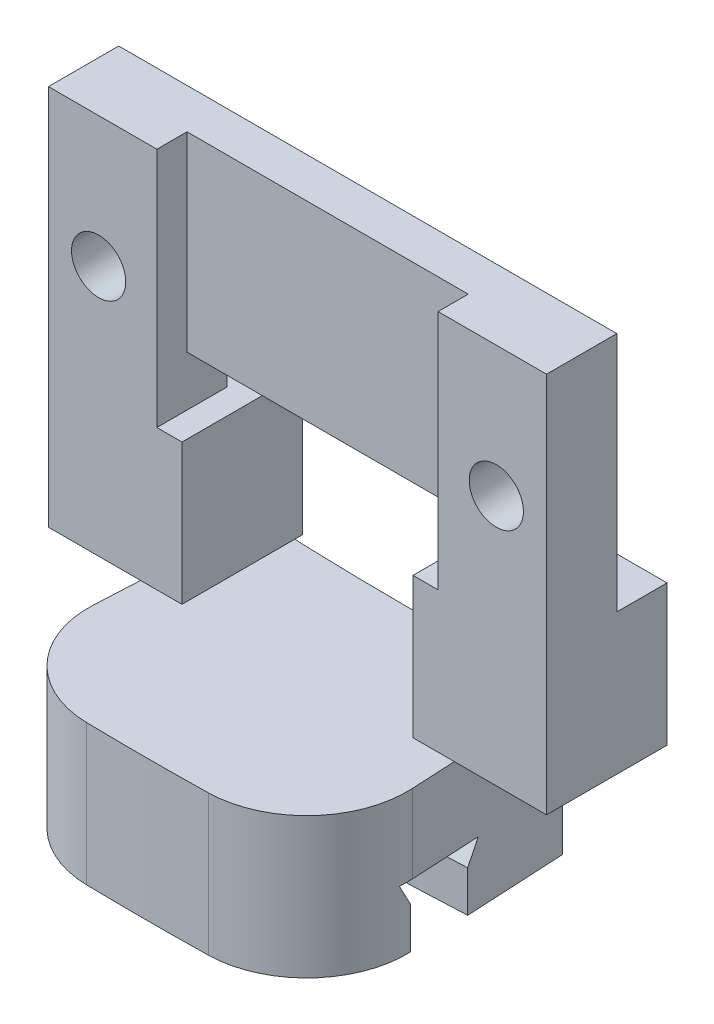
ISO-10303-21;
HEADER;
FILE_DESCRIPTION(('STEP AP214'),'2;1');
FILE_NAME('part.step','',(''),(''),'','','');
FILE_SCHEMA(('AUTOMOTIVE_DESIGN { 1 0 10303 214 1 1 1 1 }'));
ENDSEC;
DATA;
#1=APPLICATION_CONTEXT('core data for automotive mechanical design processes');
#2=APPLICATION_PROTOCOL_DEFINITION('international standard','automotive_design',2000,#1);
#3=PRODUCT_CONTEXT('',#1,'mechanical');
#4=PRODUCT('Part','Part','',(#3));
#5=PRODUCT_RELATED_PRODUCT_CATEGORY('part','',(#4));
#6=PRODUCT_DEFINITION_FORMATION('','',#4);
#7=PRODUCT_DEFINITION_CONTEXT('part definition',#1,'design');
#8=PRODUCT_DEFINITION('design','',#6,#7);
#9=PRODUCT_DEFINITION_SHAPE('','',#8);
#10=(LENGTH_UNIT() NAMED_UNIT(*) SI_UNIT(.MILLI.,.METRE.));
#11=(NAMED_UNIT(*) PLANE_ANGLE_UNIT() SI_UNIT($,.RADIAN.));
#12=(NAMED_UNIT(*) SI_UNIT($,.STERADIAN.) SOLID_ANGLE_UNIT());
#13=UNCERTAINTY_MEASURE_WITH_UNIT(LENGTH_MEASURE(1.E-05),#10,'distance_accuracy_value','');
#14=(GEOMETRIC_REPRESENTATION_CONTEXT(3) GLOBAL_UNCERTAINTY_ASSIGNED_CONTEXT((#13)) GLOBAL_UNIT_ASSIGNED_CONTEXT((#10,
#11,#12)) REPRESENTATION_CONTEXT('',''));
#15=CARTESIAN_POINT('',(0.,0.,0.));
#16=DIRECTION('',(0.,0.,1.));
#17=DIRECTION('',(1.,0.,0.));
#18=AXIS2_PLACEMENT_3D('',#15,#16,#17);
#19=CARTESIAN_POINT('',(0.,11.,0.));
#20=DIRECTION('',(0.,1.,0.));
#21=DIRECTION('',(0.,0.,1.));
#22=AXIS2_PLACEMENT_3D('',#19,#20,#21);
#23=CYLINDRICAL_SURFACE('',#22,151.5);
#24=CARTESIAN_POINT('',(0.,-4.95,0.));
#25=DIRECTION('',(0.,1.,0.));
#26=DIRECTION('',(0.,0.,1.));
#27=AXIS2_PLACEMENT_3D('',#24,#25,#26);
#28=CIRCLE('',#27,151.5);
#29=CARTESIAN_POINT('',(-7.92821712573561,-4.95,151.292410163918));
#30=VERTEX_POINT('',#29);
#31=CARTESIAN_POINT('',(7.92821712573562,-4.95,151.292410163918));
#32=VERTEX_POINT('',#31);
#33=EDGE_CURVE('E185',#30,#32,#28,.T.);
#34=ORIENTED_EDGE('',*,*,#33,.T.);
#35=DIRECTION('',(0.,1.,0.));
#36=VECTOR('',#35,1.);
#37=CARTESIAN_POINT('',(7.92821712573562,-4.95,151.292410163918));
#38=LINE('',#37,#36);
#39=CARTESIAN_POINT('',(7.92821712573505,-7.,151.292410163918));
#40=VERTEX_POINT('',#39);
#41=EDGE_CURVE('E273',#32,#40,#38,.F.);
#42=ORIENTED_EDGE('',*,*,#41,.T.);
#43=CARTESIAN_POINT('',(0.,-7.,0.));
#44=DIRECTION('',(0.,1.,0.));
#45=DIRECTION('',(0.,0.,1.));
#46=AXIS2_PLACEMENT_3D('',#43,#44,#45);
#47=CIRCLE('',#46,151.5);
#48=CARTESIAN_POINT('',(-7.92821712573561,-7.,151.292410163918));
#49=VERTEX_POINT('',#48);
#50=EDGE_CURVE('E201',#49,#40,#47,.T.);
#51=ORIENTED_EDGE('',*,*,#50,.F.);
#52=DIRECTION('',(0.,1.,0.));
#53=VECTOR('',#52,1.);
#54=CARTESIAN_POINT('',(-7.92821712573561,-7.,151.292410163918));
#55=LINE('',#54,#53);
#56=EDGE_CURVE('E275',#49,#30,#55,.T.);
#57=ORIENTED_EDGE('',*,*,#56,.T.);
#58=EDGE_LOOP('',(#34,#42,#51,#57));
#59=FACE_BOUND('',#58,.T.);
#60=ADVANCED_FACE('F43',(#59),#23,.F.);
#61=CARTESIAN_POINT('',(-7.92889737080601,-7.,151.292374515318));
#62=DIRECTION('',(0.,-1.,0.));
#63=DIRECTION('',(0.,0.,-1.));
#64=AXIS2_PLACEMENT_3D('',#61,#62,#63);
#65=PLANE('',#64);
#66=ORIENTED_EDGE('',*,*,#50,.T.);
#67=CARTESIAN_POINT('',(2.93143037233645,-7.,151.471636671597));
#68=DIRECTION('',(0.,-1.,0.));
#69=DIRECTION('',(0.,0.,-1.));
#70=AXIS2_PLACEMENT_3D('',#67,#68,#69);
#71=CIRCLE('',#70,5.);
#72=CARTESIAN_POINT('',(3.02817724931125,-7.,156.470700588151));
#73=VERTEX_POINT('',#72);
#74=EDGE_CURVE('E279',#40,#73,#71,.T.);
#75=ORIENTED_EDGE('',*,*,#74,.T.);
#76=CARTESIAN_POINT('',(0.,-7.,0.));
#77=DIRECTION('',(0.,1.,0.));
#78=DIRECTION('',(0.,0.,1.));
#79=AXIS2_PLACEMENT_3D('',#76,#77,#78);
#80=CIRCLE('',#79,156.5);
#81=CARTESIAN_POINT('',(-3.02817724931125,-7.,156.470700588151));
#82=VERTEX_POINT('',#81);
#83=EDGE_CURVE('E199',#82,#73,#80,.T.);
#84=ORIENTED_EDGE('',*,*,#83,.F.);
#85=CARTESIAN_POINT('',(-2.93143037233645,-7.,151.471636671597));
#86=DIRECTION('',(0.,-1.,0.));
#87=DIRECTION('',(0.,0.,-1.));
#88=AXIS2_PLACEMENT_3D('',#85,#86,#87);
#89=CIRCLE('',#88,5.);
#90=EDGE_CURVE('E280',#82,#49,#89,.T.);
#91=ORIENTED_EDGE('',*,*,#90,.T.);
#92=EDGE_LOOP('',(#66,#75,#84,#91));
#93=FACE_BOUND('',#92,.T.);
#94=ADVANCED_FACE('F252',(#93),#65,.T.);
#95=CARTESIAN_POINT('',(0.,11.,0.));
#96=DIRECTION('',(0.,1.,0.));
#97=DIRECTION('',(0.,0.,1.));
#98=AXIS2_PLACEMENT_3D('',#95,#96,#97);
#99=CYLINDRICAL_SURFACE('',#98,156.5);
#100=ORIENTED_EDGE('',*,*,#83,.T.);
#101=DIRECTION('',(0.,1.,0.));
#102=VECTOR('',#101,1.);
#103=CARTESIAN_POINT('',(3.02817724931125,11.,156.470700588151));
#104=LINE('',#103,#102);
#105=CARTESIAN_POINT('',(3.02817724931125,0.,156.470700588151));
#106=VERTEX_POINT('',#105);
#107=EDGE_CURVE('E65',#73,#106,#104,.T.);
#108=ORIENTED_EDGE('',*,*,#107,.T.);
#109=CARTESIAN_POINT('',(0.,0.,0.));
#110=DIRECTION('',(0.,1.,0.));
#111=DIRECTION('',(0.,0.,1.));
#112=AXIS2_PLACEMENT_3D('',#109,#110,#111);
#113=CIRCLE('',#112,156.5);
#114=CARTESIAN_POINT('',(-3.02817724931125,0.,156.470700588151));
#115=VERTEX_POINT('',#114);
#116=EDGE_CURVE('E197',#115,#106,#113,.T.);
#117=ORIENTED_EDGE('',*,*,#116,.F.);
#118=DIRECTION('',(0.,1.,0.));
#119=VECTOR('',#118,1.);
#120=CARTESIAN_POINT('',(-3.02817724931125,11.,156.470700588151));
#121=LINE('',#120,#119);
#122=EDGE_CURVE('E285',#115,#82,#121,.F.);
#123=ORIENTED_EDGE('',*,*,#122,.T.);
#124=EDGE_LOOP('',(#100,#108,#117,#123));
#125=FACE_BOUND('',#124,.T.);
#126=ADVANCED_FACE('F248',(#125),#99,.T.);
#127=CARTESIAN_POINT('',(-7.51020972086246,0.,143.303338237281));
#128=DIRECTION('',(0.,1.,0.));
#129=DIRECTION('',(0.,0.,1.));
#130=AXIS2_PLACEMENT_3D('',#127,#128,#129);
#131=PLANE('',#130);
#132=ORIENTED_EDGE('',*,*,#116,.T.);
#133=CARTESIAN_POINT('',(2.93143037233645,0.,151.471636671597));
#134=DIRECTION('',(0.,1.,0.));
#135=DIRECTION('',(0.,0.,1.));
#136=AXIS2_PLACEMENT_3D('',#133,#134,#135);
#137=CIRCLE('',#136,5.);
#138=CARTESIAN_POINT('',(7.92457804610933,0.,151.209956890382));
#139=VERTEX_POINT('',#138);
#140=EDGE_CURVE('E52',#106,#139,#137,.T.);
#141=ORIENTED_EDGE('',*,*,#140,.T.);
#142=DIRECTION('',(0.052335956242944,0.,0.998629534754574));
#143=VECTOR('',#142,1.);
#144=CARTESIAN_POINT('',(7.51020972086246,0.,143.303338237281));
#145=LINE('',#144,#143);
#146=CARTESIAN_POINT('',(7.51020972086246,0.,143.303338237281));
#147=VERTEX_POINT('',#146);
#148=EDGE_CURVE('E169',#147,#139,#145,.T.);
#149=ORIENTED_EDGE('',*,*,#148,.F.);
#150=CARTESIAN_POINT('',(0.,0.,0.));
#151=DIRECTION('',(0.,1.,0.));
#152=DIRECTION('',(0.,0.,1.));
#153=AXIS2_PLACEMENT_3D('',#150,#151,#152);
#154=CIRCLE('',#153,143.5);
#155=CARTESIAN_POINT('',(-7.51020972086246,0.,143.303338237281));
#156=VERTEX_POINT('',#155);
#157=EDGE_CURVE('E195',#156,#147,#154,.T.);
#158=ORIENTED_EDGE('',*,*,#157,.F.);
#159=DIRECTION('',(-0.0523359562429439,0.,0.998629534754574));
#160=VECTOR('',#159,1.);
#161=CARTESIAN_POINT('',(-7.51020972086246,0.,143.303338237281));
#162=LINE('',#161,#160);
#163=CARTESIAN_POINT('',(-7.92457804610932,0.,151.209956890382));
#164=VERTEX_POINT('',#163);
#165=EDGE_CURVE('E183',#156,#164,#162,.T.);
#166=ORIENTED_EDGE('',*,*,#165,.T.);
#167=CARTESIAN_POINT('',(-2.93143037233645,0.,151.471636671597));
#168=DIRECTION('',(0.,1.,0.));
#169=DIRECTION('',(0.,0.,1.));
#170=AXIS2_PLACEMENT_3D('',#167,#168,#169);
#171=CIRCLE('',#170,5.);
#172=EDGE_CURVE('E289',#164,#115,#171,.T.);
#173=ORIENTED_EDGE('',*,*,#172,.T.);
#174=EDGE_LOOP('',(#132,#141,#149,#158,#166,#173));
#175=FACE_BOUND('',#174,.T.);
#176=ADVANCED_FACE('F244',(#175),#131,.T.);
#177=CARTESIAN_POINT('',(0.,11.,0.));
#178=DIRECTION('',(0.,1.,0.));
#179=DIRECTION('',(0.,0.,1.));
#180=AXIS2_PLACEMENT_3D('',#177,#178,#179);
#181=CYLINDRICAL_SURFACE('',#180,143.5);
#182=CARTESIAN_POINT('',(0.,-7.,0.));
#183=DIRECTION('',(0.,1.,0.));
#184=DIRECTION('',(0.,0.,1.));
#185=AXIS2_PLACEMENT_3D('',#182,#183,#184);
#186=CIRCLE('',#185,143.5);
#187=CARTESIAN_POINT('',(-7.51020972086246,-7.,143.303338237281));
#188=VERTEX_POINT('',#187);
#189=CARTESIAN_POINT('',(7.51020972086246,-7.,143.303338237281));
#190=VERTEX_POINT('',#189);
#191=EDGE_CURVE('E193',#188,#190,#186,.T.);
#192=ORIENTED_EDGE('',*,*,#191,.F.);
#193=DIRECTION('',(0.,1.,0.));
#194=VECTOR('',#193,1.);
#195=CARTESIAN_POINT('',(-7.51020972086246,-7.,143.303338237281));
#196=LINE('',#195,#194);
#197=EDGE_CURVE('E180',#188,#156,#196,.T.);
#198=ORIENTED_EDGE('',*,*,#197,.T.);
#199=ORIENTED_EDGE('',*,*,#157,.T.);
#200=DIRECTION('',(0.,1.,0.));
#201=VECTOR('',#200,1.);
#202=CARTESIAN_POINT('',(7.51020972086246,-7.,143.303338237281));
#203=LINE('',#202,#201);
#204=EDGE_CURVE('E166',#190,#147,#203,.T.);
#205=ORIENTED_EDGE('',*,*,#204,.F.);
#206=EDGE_LOOP('',(#192,#198,#199,#205));
#207=FACE_BOUND('',#206,.T.);
#208=ADVANCED_FACE('F240',(#207),#181,.F.);
#209=CARTESIAN_POINT('',(-7.77188950207718,-7.,148.296485911054));
#210=DIRECTION('',(0.,-1.,0.));
#211=DIRECTION('',(0.,0.,-1.));
#212=AXIS2_PLACEMENT_3D('',#209,#210,#211);
#213=PLANE('',#212);
#214=CARTESIAN_POINT('',(0.,-7.,0.));
#215=DIRECTION('',(0.,1.,0.));
#216=DIRECTION('',(0.,0.,1.));
#217=AXIS2_PLACEMENT_3D('',#214,#215,#216);
#218=CIRCLE('',#217,148.5);
#219=CARTESIAN_POINT('',(-7.77188950207718,-7.,148.296485911054));
#220=VERTEX_POINT('',#219);
#221=CARTESIAN_POINT('',(7.77188950207718,-7.,148.296485911054));
#222=VERTEX_POINT('',#221);
#223=EDGE_CURVE('E191',#220,#222,#218,.T.);
#224=ORIENTED_EDGE('',*,*,#223,.F.);
#225=DIRECTION('',(0.052335956242944,0.,-0.998629534754574));
#226=VECTOR('',#225,1.);
#227=CARTESIAN_POINT('',(-7.77188950207718,-7.,148.296485911054));
#228=LINE('',#227,#226);
#229=EDGE_CURVE('E177',#220,#188,#228,.T.);
#230=ORIENTED_EDGE('',*,*,#229,.T.);
#231=ORIENTED_EDGE('',*,*,#191,.T.);
#232=DIRECTION('',(-0.052335956242944,0.,-0.998629534754574));
#233=VECTOR('',#232,1.);
#234=CARTESIAN_POINT('',(7.77188950207718,-7.,148.296485911054));
#235=LINE('',#234,#233);
#236=EDGE_CURVE('E161',#222,#190,#235,.T.);
#237=ORIENTED_EDGE('',*,*,#236,.F.);
#238=EDGE_LOOP('',(#224,#230,#231,#237));
#239=FACE_BOUND('',#238,.T.);
#240=ADVANCED_FACE('F236',(#239),#213,.T.);
#241=CARTESIAN_POINT('',(0.,11.,0.));
#242=DIRECTION('',(0.,1.,0.));
#243=DIRECTION('',(0.,0.,1.));
#244=AXIS2_PLACEMENT_3D('',#241,#242,#243);
#245=CYLINDRICAL_SURFACE('',#244,148.5);
#246=CARTESIAN_POINT('',(0.,-4.95,0.));
#247=DIRECTION('',(0.,1.,0.));
#248=DIRECTION('',(0.,0.,1.));
#249=AXIS2_PLACEMENT_3D('',#246,#247,#248);
#250=CIRCLE('',#249,148.5);
#251=CARTESIAN_POINT('',(-7.77188950207718,-4.95,148.296485911054));
#252=VERTEX_POINT('',#251);
#253=CARTESIAN_POINT('',(7.77188950207718,-4.95,148.296485911054));
#254=VERTEX_POINT('',#253);
#255=EDGE_CURVE('E155',#252,#254,#250,.T.);
#256=ORIENTED_EDGE('',*,*,#255,.F.);
#257=DIRECTION('',(0.,-1.,0.));
#258=VECTOR('',#257,1.);
#259=CARTESIAN_POINT('',(-7.77188950207718,-4.95,148.296485911054));
#260=LINE('',#259,#258);
#261=EDGE_CURVE('E174',#252,#220,#260,.T.);
#262=ORIENTED_EDGE('',*,*,#261,.T.);
#263=ORIENTED_EDGE('',*,*,#223,.T.);
#264=DIRECTION('',(0.,-1.,0.));
#265=VECTOR('',#264,1.);
#266=CARTESIAN_POINT('',(7.77188950207718,-4.95,148.296485911054));
#267=LINE('',#266,#265);
#268=EDGE_CURVE('E159',#254,#222,#267,.T.);
#269=ORIENTED_EDGE('',*,*,#268,.F.);
#270=EDGE_LOOP('',(#256,#262,#263,#269));
#271=FACE_BOUND('',#270,.T.);
#272=ADVANCED_FACE('F233',(#271),#245,.T.);
#273=CARTESIAN_POINT('',(0.,-3.9,0.));
#274=DIRECTION('',(0.,-1.,0.));
#275=DIRECTION('',(0.,0.,-1.));
#276=AXIS2_PLACEMENT_3D('',#273,#274,#275);
#277=CONICAL_SURFACE('',#276,147.95,0.482513295022474);
#278=CARTESIAN_POINT('',(0.,-3.9,0.));
#279=DIRECTION('',(0.,1.,0.));
#280=DIRECTION('',(0.,0.,1.));
#281=AXIS2_PLACEMENT_3D('',#278,#279,#280);
#282=CIRCLE('',#281,147.95);
#283=CARTESIAN_POINT('',(-7.74310472614356,-3.9,147.747239666939));
#284=VERTEX_POINT('',#283);
#285=CARTESIAN_POINT('',(7.74310472614356,-3.9,147.747239666939));
#286=VERTEX_POINT('',#285);
#287=EDGE_CURVE('E149',#284,#286,#282,.T.);
#288=ORIENTED_EDGE('',*,*,#287,.F.);
#289=DIRECTION('',(-0.024284249769498,-0.885831535280157,0.463371089210723));
#290=VECTOR('',#289,1.);
#291=CARTESIAN_POINT('',(-7.74310472614356,-3.9,147.747239666939));
#292=LINE('',#291,#290);
#293=EDGE_CURVE('E172',#284,#252,#292,.T.);
#294=ORIENTED_EDGE('',*,*,#293,.T.);
#295=ORIENTED_EDGE('',*,*,#255,.T.);
#296=DIRECTION('',(0.024284249769498,-0.885831535280157,0.463371089210723));
#297=VECTOR('',#296,1.);
#298=CARTESIAN_POINT('',(7.74310472614356,-3.9,147.747239666939));
#299=LINE('',#298,#297);
#300=EDGE_CURVE('E142',#286,#254,#299,.T.);
#301=ORIENTED_EDGE('',*,*,#300,.F.);
#302=EDGE_LOOP('',(#288,#294,#295,#301));
#303=FACE_BOUND('',#302,.T.);
#304=ADVANCED_FACE('F158',(#303),#277,.T.);
#305=CARTESIAN_POINT('',(-7.74310472614356,-3.9,147.747239666939));
#306=DIRECTION('',(0.,-1.,0.));
#307=DIRECTION('',(0.,0.,-1.));
#308=AXIS2_PLACEMENT_3D('',#305,#306,#307);
#309=PLANE('',#308);
#310=DIRECTION('',(-0.052335956242944,0.,-0.998629534754574));
#311=VECTOR('',#310,1.);
#312=CARTESIAN_POINT('',(7.74310472614356,-3.9,147.747239666939));
#313=LINE('',#312,#311);
#314=CARTESIAN_POINT('',(7.92457804610933,-3.9,151.209956890382));
#315=VERTEX_POINT('',#314);
#316=EDGE_CURVE('E136',#315,#286,#313,.T.);
#317=ORIENTED_EDGE('',*,*,#316,.F.);
#318=CARTESIAN_POINT('',(2.93143037233645,-3.9,151.471636671597));
#319=DIRECTION('',(0.,-1.,0.));
#320=DIRECTION('',(0.,0.,-1.));
#321=AXIS2_PLACEMENT_3D('',#318,#319,#320);
#322=CIRCLE('',#321,5.);
#323=CARTESIAN_POINT('',(7.91756671513949,-3.9,151.843717806537));
#324=VERTEX_POINT('',#323);
#325=EDGE_CURVE('E207',#315,#324,#322,.T.);
#326=ORIENTED_EDGE('',*,*,#325,.T.);
#327=CARTESIAN_POINT('',(0.,-3.9,0.));
#328=DIRECTION('',(0.,1.,0.));
#329=DIRECTION('',(0.,0.,1.));
#330=AXIS2_PLACEMENT_3D('',#327,#328,#329);
#331=CIRCLE('',#330,152.05);
#332=CARTESIAN_POINT('',(-7.91756671513931,-3.9,151.843717806537));
#333=VERTEX_POINT('',#332);
#334=EDGE_CURVE('E156',#333,#324,#331,.T.);
#335=ORIENTED_EDGE('',*,*,#334,.F.);
#336=CARTESIAN_POINT('',(-2.93143037233645,-3.9,151.471636671597));
#337=DIRECTION('',(0.,-1.,0.));
#338=DIRECTION('',(0.,0.,-1.));
#339=AXIS2_PLACEMENT_3D('',#336,#337,#338);
#340=CIRCLE('',#339,5.);
#341=CARTESIAN_POINT('',(-7.92457804610932,-3.9,151.209956890382));
#342=VERTEX_POINT('',#341);
#343=EDGE_CURVE('E205',#333,#342,#340,.T.);
#344=ORIENTED_EDGE('',*,*,#343,.T.);
#345=DIRECTION('',(0.0523359562429439,0.,-0.998629534754574));
#346=VECTOR('',#345,1.);
#347=CARTESIAN_POINT('',(-7.74310472614356,-3.9,147.747239666939));
#348=LINE('',#347,#346);
#349=EDGE_CURVE('E151',#342,#284,#348,.T.);
#350=ORIENTED_EDGE('',*,*,#349,.T.);
#351=ORIENTED_EDGE('',*,*,#287,.T.);
#352=EDGE_LOOP('',(#317,#326,#335,#344,#350,#351));
#353=FACE_BOUND('',#352,.T.);
#354=ADVANCED_FACE('F150',(#353),#309,.T.);
#355=CARTESIAN_POINT('',(0.,-4.95,0.));
#356=DIRECTION('',(0.,1.,0.));
#357=DIRECTION('',(0.,0.,1.));
#358=AXIS2_PLACEMENT_3D('',#355,#356,#357);
#359=CONICAL_SURFACE('',#358,151.5,0.482513295022474);
#360=ORIENTED_EDGE('',*,*,#334,.T.);
#361=CARTESIAN_POINT('',(7.91756671513949,-3.9,151.843717806537));
#362=CARTESIAN_POINT('',(7.92441773365145,-4.07485069814179,151.751646904177));
#363=CARTESIAN_POINT('',(7.92873077712382,-4.24977604721284,151.659669149445));
#364=CARTESIAN_POINT('',(7.93228091398937,-4.59977604721283,151.475899935239));
#365=CARTESIAN_POINT('',(7.93151800738257,-4.77485069814177,151.384108475764));
#366=CARTESIAN_POINT('',(7.9282171257362,-4.94999999999997,151.292410163918));
#367=B_SPLINE_CURVE_WITH_KNOTS('',3,(#361,#362,#363,#364,#365,#366),.UNSPECIFIED.,.F.,.F.,(4,2,
4),(0.,0.593040038373709,1.18608007674517),.UNSPECIFIED.);
#368=EDGE_CURVE('E215',#324,#32,#367,.T.);
#369=ORIENTED_EDGE('',*,*,#368,.T.);
#370=ORIENTED_EDGE('',*,*,#33,.F.);
#371=CARTESIAN_POINT('',(-7.92821712573561,-4.95,151.292410163918));
#372=CARTESIAN_POINT('',(-7.93151800738219,-4.77485069814178,151.384108475764));
#373=CARTESIAN_POINT('',(-7.93228091398919,-4.59977604721284,151.475899935239));
#374=CARTESIAN_POINT('',(-7.928730777124,-4.24977604721284,151.659669149445));
#375=CARTESIAN_POINT('',(-7.9244177336518,-4.07485069814178,151.751646904177));
#376=CARTESIAN_POINT('',(-7.91756671513999,-3.9,151.843717806537));
#377=B_SPLINE_CURVE_WITH_KNOTS('',3,(#371,#372,#373,#374,#375,#376),.UNSPECIFIED.,.F.,.F.,(4,2,
4),(0.,0.593040038371475,1.18608007674518),.UNSPECIFIED.);
#378=EDGE_CURVE('E209',#30,#333,#377,.T.);
#379=ORIENTED_EDGE('',*,*,#378,.T.);
#380=EDGE_LOOP('',(#360,#369,#370,#379));
#381=FACE_BOUND('',#380,.T.);
#382=ADVANCED_FACE('F220',(#381),#359,.F.);
#383=CARTESIAN_POINT('',(0.,0.,0.));
#384=DIRECTION('',(-0.998629534754574,0.,-0.052335956242944));
#385=DIRECTION('',(-0.052335956242944,0.,0.998629534754574));
#386=AXIS2_PLACEMENT_3D('',#383,#384,#385);
#387=PLANE('',#386);
#388=ORIENTED_EDGE('',*,*,#349,.F.);
#389=DIRECTION('',(0.,1.,0.));
#390=VECTOR('',#389,1.);
#391=CARTESIAN_POINT('',(-7.92457804610933,0.,151.209956890382));
#392=LINE('',#391,#390);
#393=EDGE_CURVE('E12',#342,#164,#392,.T.);
#394=ORIENTED_EDGE('',*,*,#393,.T.);
#395=ORIENTED_EDGE('',*,*,#165,.F.);
#396=ORIENTED_EDGE('',*,*,#197,.F.);
#397=ORIENTED_EDGE('',*,*,#229,.F.);
#398=ORIENTED_EDGE('',*,*,#261,.F.);
#399=ORIENTED_EDGE('',*,*,#293,.F.);
#400=EDGE_LOOP('',(#388,#394,#395,#396,#397,#398,#399));
#401=FACE_BOUND('',#400,.T.);
#402=ADVANCED_FACE('F225',(#401),#387,.T.);
#403=CARTESIAN_POINT('',(0.,0.,0.));
#404=DIRECTION('',(-0.998629534754574,0.,0.052335956242944));
#405=DIRECTION('',(0.052335956242944,0.,0.998629534754574));
#406=AXIS2_PLACEMENT_3D('',#403,#404,#405);
#407=PLANE('',#406);
#408=ORIENTED_EDGE('',*,*,#148,.T.);
#409=DIRECTION('',(0.,-1.,0.));
#410=VECTOR('',#409,1.);
#411=CARTESIAN_POINT('',(7.92457804610933,-7.,151.209956890382));
#412=LINE('',#411,#410);
#413=EDGE_CURVE('E145',#139,#315,#412,.T.);
#414=ORIENTED_EDGE('',*,*,#413,.T.);
#415=ORIENTED_EDGE('',*,*,#316,.T.);
#416=ORIENTED_EDGE('',*,*,#300,.T.);
#417=ORIENTED_EDGE('',*,*,#268,.T.);
#418=ORIENTED_EDGE('',*,*,#236,.T.);
#419=ORIENTED_EDGE('',*,*,#204,.T.);
#420=EDGE_LOOP('',(#408,#414,#415,#416,#417,#418,#419));
#421=FACE_BOUND('',#420,.T.);
#422=ADVANCED_FACE('F139',(#421),#407,.F.);
#423=CARTESIAN_POINT('',(2.93143037233645,11.,151.471636671597));
#424=DIRECTION('',(0.,1.,0.));
#425=DIRECTION('',(0.,0.,1.));
#426=AXIS2_PLACEMENT_3D('',#423,#424,#425);
#427=CYLINDRICAL_SURFACE('',#426,5.);
#428=ORIENTED_EDGE('',*,*,#140,.F.);
#429=ORIENTED_EDGE('',*,*,#107,.F.);
#430=ORIENTED_EDGE('',*,*,#74,.F.);
#431=ORIENTED_EDGE('',*,*,#41,.F.);
#432=ORIENTED_EDGE('',*,*,#368,.F.);
#433=ORIENTED_EDGE('',*,*,#325,.F.);
#434=ORIENTED_EDGE('',*,*,#413,.F.);
#435=EDGE_LOOP('',(#428,#429,#430,#431,#432,#433,#434));
#436=FACE_BOUND('',#435,.T.);
#437=ADVANCED_FACE('F255',(#436),#427,.T.);
#438=CARTESIAN_POINT('',(-2.93143037233645,11.,151.471636671597));
#439=DIRECTION('',(0.,1.,0.));
#440=DIRECTION('',(0.,0.,1.));
#441=AXIS2_PLACEMENT_3D('',#438,#439,#440);
#442=CYLINDRICAL_SURFACE('',#441,5.);
#443=ORIENTED_EDGE('',*,*,#172,.F.);
#444=ORIENTED_EDGE('',*,*,#393,.F.);
#445=ORIENTED_EDGE('',*,*,#343,.F.);
#446=ORIENTED_EDGE('',*,*,#378,.F.);
#447=ORIENTED_EDGE('',*,*,#56,.F.);
#448=ORIENTED_EDGE('',*,*,#90,.F.);
#449=ORIENTED_EDGE('',*,*,#122,.F.);
#450=EDGE_LOOP('',(#443,#444,#445,#446,#447,#448,#449));
#451=FACE_BOUND('',#450,.T.);
#452=ADVANCED_FACE('F45',(#451),#442,.T.);
#453=CLOSED_SHELL('',(#60,#94,#126,#176,#208,#240,#272,#304,#354,#382,#402,#422,#437,#452));
#454=MANIFOLD_SOLID_BREP('B2',#453);
#455=CARTESIAN_POINT('',(0.,0.,143.));
#456=DIRECTION('',(0.,0.,1.));
#457=DIRECTION('',(1.,0.,0.));
#458=AXIS2_PLACEMENT_3D('',#455,#456,#457);
#459=PLANE('',#458);
#460=DIRECTION('',(0.,-1.,0.));
#461=VECTOR('',#460,1.);
#462=CARTESIAN_POINT('',(-12.4,19.,143.));
#463=LINE('',#462,#461);
#464=CARTESIAN_POINT('',(-12.4,7.,143.));
#465=VERTEX_POINT('',#464);
#466=CARTESIAN_POINT('',(-12.4,0.,143.));
#467=VERTEX_POINT('',#466);
#468=EDGE_CURVE('E484',#465,#467,#463,.T.);
#469=ORIENTED_EDGE('',*,*,#468,.F.);
#470=DIRECTION('',(1.,0.,0.));
#471=VECTOR('',#470,1.);
#472=CARTESIAN_POINT('',(-7.,7.,143.));
#473=LINE('',#472,#471);
#474=CARTESIAN_POINT('',(-5.75,7.,143.));
#475=VERTEX_POINT('',#474);
#476=EDGE_CURVE('E576',#465,#475,#473,.T.);
#477=ORIENTED_EDGE('',*,*,#476,.T.);
#478=DIRECTION('',(0.,1.,0.));
#479=VECTOR('',#478,1.);
#480=CARTESIAN_POINT('',(-5.75,0.,143.));
#481=LINE('',#480,#479);
#482=CARTESIAN_POINT('',(-5.75,0.,143.));
#483=VERTEX_POINT('',#482);
#484=EDGE_CURVE('E489',#483,#475,#481,.T.);
#485=ORIENTED_EDGE('',*,*,#484,.F.);
#486=DIRECTION('',(1.,0.,0.));
#487=VECTOR('',#486,1.);
#488=CARTESIAN_POINT('',(-12.4,0.,143.));
#489=LINE('',#488,#487);
#490=EDGE_CURVE('E486',#467,#483,#489,.T.);
#491=ORIENTED_EDGE('',*,*,#490,.F.);
#492=EDGE_LOOP('',(#469,#477,#485,#491));
#493=FACE_BOUND('',#492,.T.);
#494=ADVANCED_FACE('F384',(#493),#459,.F.);
#495=CARTESIAN_POINT('',(0.,0.,149.));
#496=DIRECTION('',(0.,0.,1.));
#497=DIRECTION('',(1.,0.,0.));
#498=AXIS2_PLACEMENT_3D('',#495,#496,#497);
#499=PLANE('',#498);
#500=DIRECTION('',(0.,-1.,0.));
#501=VECTOR('',#500,1.);
#502=CARTESIAN_POINT('',(-7.,19.,149.));
#503=LINE('',#502,#501);
#504=CARTESIAN_POINT('',(-7.,19.,149.));
#505=VERTEX_POINT('',#504);
#506=CARTESIAN_POINT('',(-7.,7.,149.));
#507=VERTEX_POINT('',#506);
#508=EDGE_CURVE('E537',#505,#507,#503,.T.);
#509=ORIENTED_EDGE('',*,*,#508,.F.);
#510=DIRECTION('',(-1.,0.,0.));
#511=VECTOR('',#510,1.);
#512=CARTESIAN_POINT('',(-12.4,19.,149.));
#513=LINE('',#512,#511);
#514=CARTESIAN_POINT('',(-12.4,19.,149.));
#515=VERTEX_POINT('',#514);
#516=EDGE_CURVE('E407',#505,#515,#513,.T.);
#517=ORIENTED_EDGE('',*,*,#516,.T.);
#518=DIRECTION('',(0.,-1.,0.));
#519=VECTOR('',#518,1.);
#520=CARTESIAN_POINT('',(-12.4,19.,149.));
#521=LINE('',#520,#519);
#522=CARTESIAN_POINT('',(-12.4,0.,149.));
#523=VERTEX_POINT('',#522);
#524=EDGE_CURVE('E497',#515,#523,#521,.T.);
#525=ORIENTED_EDGE('',*,*,#524,.T.);
#526=DIRECTION('',(1.,0.,0.));
#527=VECTOR('',#526,1.);
#528=CARTESIAN_POINT('',(-12.4,0.,149.));
#529=LINE('',#528,#527);
#530=CARTESIAN_POINT('',(-5.75,0.,149.));
#531=VERTEX_POINT('',#530);
#532=EDGE_CURVE('E439',#523,#531,#529,.T.);
#533=ORIENTED_EDGE('',*,*,#532,.T.);
#534=DIRECTION('',(0.,1.,0.));
#535=VECTOR('',#534,1.);
#536=CARTESIAN_POINT('',(-5.75,0.,149.));
#537=LINE('',#536,#535);
#538=CARTESIAN_POINT('',(-5.75,7.,149.));
#539=VERTEX_POINT('',#538);
#540=EDGE_CURVE('E558',#531,#539,#537,.T.);
#541=ORIENTED_EDGE('',*,*,#540,.T.);
#542=DIRECTION('',(1.,0.,0.));
#543=VECTOR('',#542,1.);
#544=CARTESIAN_POINT('',(-7.,7.,149.));
#545=LINE('',#544,#543);
#546=EDGE_CURVE('E531',#507,#539,#545,.T.);
#547=ORIENTED_EDGE('',*,*,#546,.F.);
#548=EDGE_LOOP('',(#509,#517,#525,#533,#541,#547));
#549=FACE_BOUND('',#548,.T.);
#550=CARTESIAN_POINT('',(-9.9,12.5,149.));
#551=DIRECTION('',(0.,0.,1.));
#552=DIRECTION('',(1.,0.,0.));
#553=AXIS2_PLACEMENT_3D('',#550,#551,#552);
#554=CIRCLE('',#553,1.35);
#555=CARTESIAN_POINT('',(-8.55,12.5,149.));
#556=VERTEX_POINT('',#555);
#557=EDGE_CURVE('E487',#556,#556,#554,.T.);
#558=ORIENTED_EDGE('',*,*,#557,.F.);
#559=EDGE_LOOP('',(#558));
#560=FACE_BOUND('',#559,.T.);
#561=ADVANCED_FACE('F563',(#549,#560),#499,.T.);
#562=CARTESIAN_POINT('',(-12.4,19.,149.));
#563=DIRECTION('',(1.,0.,0.));
#564=DIRECTION('',(0.,1.,0.));
#565=AXIS2_PLACEMENT_3D('',#562,#563,#564);
#566=PLANE('',#565);
#567=DIRECTION('',(0.,0.,-1.));
#568=VECTOR('',#567,1.);
#569=CARTESIAN_POINT('',(-12.4,19.,149.));
#570=LINE('',#569,#568);
#571=CARTESIAN_POINT('',(-12.4,19.,145.5));
#572=VERTEX_POINT('',#571);
#573=EDGE_CURVE('E483',#515,#572,#570,.T.);
#574=ORIENTED_EDGE('',*,*,#573,.T.);
#575=DIRECTION('',(0.,-1.,0.));
#576=VECTOR('',#575,1.);
#577=CARTESIAN_POINT('',(-12.4,19.,145.5));
#578=LINE('',#577,#576);
#579=CARTESIAN_POINT('',(-12.4,7.,145.5));
#580=VERTEX_POINT('',#579);
#581=EDGE_CURVE('E660',#572,#580,#578,.T.);
#582=ORIENTED_EDGE('',*,*,#581,.T.);
#583=DIRECTION('',(0.,0.,-1.));
#584=VECTOR('',#583,1.);
#585=CARTESIAN_POINT('',(-12.4,7.,145.5));
#586=LINE('',#585,#584);
#587=EDGE_CURVE('E663',#580,#465,#586,.T.);
#588=ORIENTED_EDGE('',*,*,#587,.T.);
#589=ORIENTED_EDGE('',*,*,#468,.T.);
#590=DIRECTION('',(0.,0.,-1.));
#591=VECTOR('',#590,1.);
#592=CARTESIAN_POINT('',(-12.4,0.,149.));
#593=LINE('',#592,#591);
#594=EDGE_CURVE('E511',#523,#467,#593,.T.);
#595=ORIENTED_EDGE('',*,*,#594,.F.);
#596=ORIENTED_EDGE('',*,*,#524,.F.);
#597=EDGE_LOOP('',(#574,#582,#588,#589,#595,#596));
#598=FACE_BOUND('',#597,.T.);
#599=ADVANCED_FACE('F386',(#598),#566,.F.);
#600=CARTESIAN_POINT('',(-12.4,0.,149.));
#601=DIRECTION('',(0.,1.,0.));
#602=DIRECTION('',(-1.,0.,0.));
#603=AXIS2_PLACEMENT_3D('',#600,#601,#602);
#604=PLANE('',#603);
#605=ORIENTED_EDGE('',*,*,#490,.T.);
#606=DIRECTION('',(0.,0.,-1.));
#607=VECTOR('',#606,1.);
#608=CARTESIAN_POINT('',(-5.75,0.,149.));
#609=LINE('',#608,#607);
#610=EDGE_CURVE('E508',#531,#483,#609,.T.);
#611=ORIENTED_EDGE('',*,*,#610,.F.);
#612=ORIENTED_EDGE('',*,*,#532,.F.);
#613=ORIENTED_EDGE('',*,*,#594,.T.);
#614=EDGE_LOOP('',(#605,#611,#612,#613));
#615=FACE_BOUND('',#614,.T.);
#616=ADVANCED_FACE('F625',(#615),#604,.F.);
#617=CARTESIAN_POINT('',(-5.75,0.,149.));
#618=DIRECTION('',(-1.,0.,0.));
#619=DIRECTION('',(0.,0.,1.));
#620=AXIS2_PLACEMENT_3D('',#617,#618,#619);
#621=PLANE('',#620);
#622=ORIENTED_EDGE('',*,*,#484,.T.);
#623=DIRECTION('',(0.,0.,-1.));
#624=VECTOR('',#623,1.);
#625=CARTESIAN_POINT('',(-5.75,7.,149.));
#626=LINE('',#625,#624);
#627=EDGE_CURVE('E505',#539,#475,#626,.T.);
#628=ORIENTED_EDGE('',*,*,#627,.F.);
#629=ORIENTED_EDGE('',*,*,#540,.F.);
#630=ORIENTED_EDGE('',*,*,#610,.T.);
#631=EDGE_LOOP('',(#622,#628,#629,#630));
#632=FACE_BOUND('',#631,.T.);
#633=ADVANCED_FACE('F567',(#632),#621,.F.);
#634=CARTESIAN_POINT('',(5.75,7.,149.));
#635=DIRECTION('',(1.,0.,0.));
#636=DIRECTION('',(0.,0.,-1.));
#637=AXIS2_PLACEMENT_3D('',#634,#635,#636);
#638=PLANE('',#637);
#639=DIRECTION('',(0.,-1.,0.));
#640=VECTOR('',#639,1.);
#641=CARTESIAN_POINT('',(5.75,7.,143.));
#642=LINE('',#641,#640);
#643=CARTESIAN_POINT('',(5.75,7.,143.));
#644=VERTEX_POINT('',#643);
#645=CARTESIAN_POINT('',(5.75,0.,143.));
#646=VERTEX_POINT('',#645);
#647=EDGE_CURVE('E492',#644,#646,#642,.T.);
#648=ORIENTED_EDGE('',*,*,#647,.T.);
#649=DIRECTION('',(0.,0.,-1.));
#650=VECTOR('',#649,1.);
#651=CARTESIAN_POINT('',(5.75,0.,149.));
#652=LINE('',#651,#650);
#653=CARTESIAN_POINT('',(5.75,0.,149.));
#654=VERTEX_POINT('',#653);
#655=EDGE_CURVE('E470',#654,#646,#652,.T.);
#656=ORIENTED_EDGE('',*,*,#655,.F.);
#657=DIRECTION('',(0.,-1.,0.));
#658=VECTOR('',#657,1.);
#659=CARTESIAN_POINT('',(5.75,7.,149.));
#660=LINE('',#659,#658);
#661=CARTESIAN_POINT('',(5.75,7.,149.));
#662=VERTEX_POINT('',#661);
#663=EDGE_CURVE('E462',#662,#654,#660,.T.);
#664=ORIENTED_EDGE('',*,*,#663,.F.);
#665=DIRECTION('',(0.,0.,-1.));
#666=VECTOR('',#665,1.);
#667=CARTESIAN_POINT('',(5.75,7.,149.));
#668=LINE('',#667,#666);
#669=EDGE_CURVE('E502',#662,#644,#668,.T.);
#670=ORIENTED_EDGE('',*,*,#669,.T.);
#671=EDGE_LOOP('',(#648,#656,#664,#670));
#672=FACE_BOUND('',#671,.T.);
#673=ADVANCED_FACE('F631',(#672),#638,.F.);
#674=CARTESIAN_POINT('',(5.75,0.,149.));
#675=DIRECTION('',(0.,1.,0.));
#676=DIRECTION('',(-1.,0.,0.));
#677=AXIS2_PLACEMENT_3D('',#674,#675,#676);
#678=PLANE('',#677);
#679=DIRECTION('',(1.,0.,0.));
#680=VECTOR('',#679,1.);
#681=CARTESIAN_POINT('',(5.75,0.,143.));
#682=LINE('',#681,#680);
#683=CARTESIAN_POINT('',(12.4,0.,143.));
#684=VERTEX_POINT('',#683);
#685=EDGE_CURVE('E430',#646,#684,#682,.T.);
#686=ORIENTED_EDGE('',*,*,#685,.T.);
#687=DIRECTION('',(0.,0.,-1.));
#688=VECTOR('',#687,1.);
#689=CARTESIAN_POINT('',(12.4,0.,149.));
#690=LINE('',#689,#688);
#691=CARTESIAN_POINT('',(12.4,0.,149.));
#692=VERTEX_POINT('',#691);
#693=EDGE_CURVE('E465',#692,#684,#690,.T.);
#694=ORIENTED_EDGE('',*,*,#693,.F.);
#695=DIRECTION('',(1.,0.,0.));
#696=VECTOR('',#695,1.);
#697=CARTESIAN_POINT('',(5.75,0.,149.));
#698=LINE('',#697,#696);
#699=EDGE_CURVE('E452',#654,#692,#698,.T.);
#700=ORIENTED_EDGE('',*,*,#699,.F.);
#701=ORIENTED_EDGE('',*,*,#655,.T.);
#702=EDGE_LOOP('',(#686,#694,#700,#701));
#703=FACE_BOUND('',#702,.T.);
#704=ADVANCED_FACE('F466',(#703),#678,.F.);
#705=CARTESIAN_POINT('',(12.4,19.,149.));
#706=DIRECTION('',(-1.,0.,0.));
#707=DIRECTION('',(0.,-1.,0.));
#708=AXIS2_PLACEMENT_3D('',#705,#706,#707);
#709=PLANE('',#708);
#710=DIRECTION('',(0.,0.,-1.));
#711=VECTOR('',#710,1.);
#712=CARTESIAN_POINT('',(12.4,7.,145.5));
#713=LINE('',#712,#711);
#714=CARTESIAN_POINT('',(12.4,7.,145.5));
#715=VERTEX_POINT('',#714);
#716=CARTESIAN_POINT('',(12.4,7.,143.));
#717=VERTEX_POINT('',#716);
#718=EDGE_CURVE('E657',#715,#717,#713,.T.);
#719=ORIENTED_EDGE('',*,*,#718,.F.);
#720=DIRECTION('',(0.,-1.,0.));
#721=VECTOR('',#720,1.);
#722=CARTESIAN_POINT('',(12.4,19.,145.5));
#723=LINE('',#722,#721);
#724=CARTESIAN_POINT('',(12.4,19.,145.5));
#725=VERTEX_POINT('',#724);
#726=EDGE_CURVE('E661',#725,#715,#723,.T.);
#727=ORIENTED_EDGE('',*,*,#726,.F.);
#728=DIRECTION('',(0.,0.,-1.));
#729=VECTOR('',#728,1.);
#730=CARTESIAN_POINT('',(12.4,19.,149.));
#731=LINE('',#730,#729);
#732=CARTESIAN_POINT('',(12.4,19.,149.));
#733=VERTEX_POINT('',#732);
#734=EDGE_CURVE('E471',#733,#725,#731,.T.);
#735=ORIENTED_EDGE('',*,*,#734,.F.);
#736=DIRECTION('',(0.,1.,0.));
#737=VECTOR('',#736,1.);
#738=CARTESIAN_POINT('',(12.4,19.,149.));
#739=LINE('',#738,#737);
#740=EDGE_CURVE('E458',#692,#733,#739,.T.);
#741=ORIENTED_EDGE('',*,*,#740,.F.);
#742=ORIENTED_EDGE('',*,*,#693,.T.);
#743=DIRECTION('',(0.,1.,0.));
#744=VECTOR('',#743,1.);
#745=CARTESIAN_POINT('',(12.4,19.,143.));
#746=LINE('',#745,#744);
#747=EDGE_CURVE('E495',#684,#717,#746,.T.);
#748=ORIENTED_EDGE('',*,*,#747,.T.);
#749=EDGE_LOOP('',(#719,#727,#735,#741,#742,#748));
#750=FACE_BOUND('',#749,.T.);
#751=ADVANCED_FACE('F474',(#750),#709,.F.);
#752=CARTESIAN_POINT('',(-12.4,19.,149.));
#753=DIRECTION('',(0.,-1.,0.));
#754=DIRECTION('',(0.,0.,-1.));
#755=AXIS2_PLACEMENT_3D('',#752,#753,#754);
#756=PLANE('',#755);
#757=ORIENTED_EDGE('',*,*,#734,.T.);
#758=DIRECTION('',(1.,0.,0.));
#759=VECTOR('',#758,1.);
#760=CARTESIAN_POINT('',(-12.4,19.,145.5));
#761=LINE('',#760,#759);
#762=EDGE_CURVE('E621',#572,#725,#761,.T.);
#763=ORIENTED_EDGE('',*,*,#762,.F.);
#764=ORIENTED_EDGE('',*,*,#573,.F.);
#765=ORIENTED_EDGE('',*,*,#516,.F.);
#766=DIRECTION('',(0.,0.,1.));
#767=VECTOR('',#766,1.);
#768=CARTESIAN_POINT('',(-7.,19.,147.5));
#769=LINE('',#768,#767);
#770=CARTESIAN_POINT('',(-7.,19.,147.5));
#771=VERTEX_POINT('',#770);
#772=EDGE_CURVE('E541',#771,#505,#769,.T.);
#773=ORIENTED_EDGE('',*,*,#772,.F.);
#774=DIRECTION('',(-1.,0.,0.));
#775=VECTOR('',#774,1.);
#776=CARTESIAN_POINT('',(-7.,19.,147.5));
#777=LINE('',#776,#775);
#778=CARTESIAN_POINT('',(7.,19.,147.5));
#779=VERTEX_POINT('',#778);
#780=EDGE_CURVE('E551',#779,#771,#777,.T.);
#781=ORIENTED_EDGE('',*,*,#780,.F.);
#782=DIRECTION('',(0.,0.,1.));
#783=VECTOR('',#782,1.);
#784=CARTESIAN_POINT('',(7.,19.,147.5));
#785=LINE('',#784,#783);
#786=CARTESIAN_POINT('',(7.,19.,149.));
#787=VERTEX_POINT('',#786);
#788=EDGE_CURVE('E545',#779,#787,#785,.T.);
#789=ORIENTED_EDGE('',*,*,#788,.T.);
#790=EDGE_CURVE('E479',#733,#787,#513,.T.);
#791=ORIENTED_EDGE('',*,*,#790,.F.);
#792=EDGE_LOOP('',(#757,#763,#764,#765,#773,#781,#789,#791));
#793=FACE_BOUND('',#792,.T.);
#794=ADVANCED_FACE('F615',(#793),#756,.F.);
#795=DIRECTION('',(0.,1.,0.));
#796=VECTOR('',#795,1.);
#797=CARTESIAN_POINT('',(7.,19.,149.));
#798=LINE('',#797,#796);
#799=CARTESIAN_POINT('',(7.,7.,149.));
#800=VERTEX_POINT('',#799);
#801=EDGE_CURVE('E526',#800,#787,#798,.T.);
#802=ORIENTED_EDGE('',*,*,#801,.F.);
#803=DIRECTION('',(1.,0.,0.));
#804=VECTOR('',#803,1.);
#805=CARTESIAN_POINT('',(0.,7.,149.));
#806=LINE('',#805,#804);
#807=EDGE_CURVE('E392',#662,#800,#806,.T.);
#808=ORIENTED_EDGE('',*,*,#807,.F.);
#809=ORIENTED_EDGE('',*,*,#663,.T.);
#810=ORIENTED_EDGE('',*,*,#699,.T.);
#811=ORIENTED_EDGE('',*,*,#740,.T.);
#812=ORIENTED_EDGE('',*,*,#790,.T.);
#813=EDGE_LOOP('',(#802,#808,#809,#810,#811,#812));
#814=FACE_BOUND('',#813,.T.);
#815=CARTESIAN_POINT('',(9.9,12.5,149.));
#816=DIRECTION('',(0.,0.,1.));
#817=DIRECTION('',(1.,0.,0.));
#818=AXIS2_PLACEMENT_3D('',#815,#816,#817);
#819=CIRCLE('',#818,1.35);
#820=CARTESIAN_POINT('',(11.25,12.5,149.));
#821=VERTEX_POINT('',#820);
#822=EDGE_CURVE('E544',#821,#821,#819,.T.);
#823=ORIENTED_EDGE('',*,*,#822,.F.);
#824=EDGE_LOOP('',(#823));
#825=FACE_BOUND('',#824,.T.);
#826=ADVANCED_FACE('F454',(#814,#825),#499,.T.);
#827=EDGE_CURVE('E585',#644,#717,#473,.T.);
#828=ORIENTED_EDGE('',*,*,#827,.T.);
#829=ORIENTED_EDGE('',*,*,#747,.F.);
#830=ORIENTED_EDGE('',*,*,#685,.F.);
#831=ORIENTED_EDGE('',*,*,#647,.F.);
#832=EDGE_LOOP('',(#828,#829,#830,#831));
#833=FACE_BOUND('',#832,.T.);
#834=ADVANCED_FACE('F635',(#833),#459,.F.);
#835=CARTESIAN_POINT('',(-9.9,12.5,143.));
#836=DIRECTION('',(0.,0.,1.));
#837=DIRECTION('',(1.,0.,0.));
#838=AXIS2_PLACEMENT_3D('',#835,#836,#837);
#839=CYLINDRICAL_SURFACE('',#838,1.35);
#840=CARTESIAN_POINT('',(-9.9,12.5,145.5));
#841=DIRECTION('',(0.,0.,1.));
#842=DIRECTION('',(1.,0.,0.));
#843=AXIS2_PLACEMENT_3D('',#840,#841,#842);
#844=CIRCLE('',#843,1.35);
#845=CARTESIAN_POINT('',(-8.55,12.5,145.5));
#846=VERTEX_POINT('',#845);
#847=EDGE_CURVE('E594',#846,#846,#844,.F.);
#848=ORIENTED_EDGE('',*,*,#847,.T.);
#849=EDGE_LOOP('',(#848));
#850=FACE_BOUND('',#849,.T.);
#851=ORIENTED_EDGE('',*,*,#557,.T.);
#852=EDGE_LOOP('',(#851));
#853=FACE_BOUND('',#852,.T.);
#854=ADVANCED_FACE('F642',(#850,#853),#839,.F.);
#855=CARTESIAN_POINT('',(9.9,12.5,143.));
#856=DIRECTION('',(0.,0.,1.));
#857=DIRECTION('',(1.,0.,0.));
#858=AXIS2_PLACEMENT_3D('',#855,#856,#857);
#859=CYLINDRICAL_SURFACE('',#858,1.35);
#860=CARTESIAN_POINT('',(9.9,12.5,145.5));
#861=DIRECTION('',(0.,0.,1.));
#862=DIRECTION('',(1.,0.,0.));
#863=AXIS2_PLACEMENT_3D('',#860,#861,#862);
#864=CIRCLE('',#863,1.35);
#865=CARTESIAN_POINT('',(11.25,12.5,145.5));
#866=VERTEX_POINT('',#865);
#867=EDGE_CURVE('E674',#866,#866,#864,.F.);
#868=ORIENTED_EDGE('',*,*,#867,.T.);
#869=EDGE_LOOP('',(#868));
#870=FACE_BOUND('',#869,.T.);
#871=ORIENTED_EDGE('',*,*,#822,.T.);
#872=EDGE_LOOP('',(#871));
#873=FACE_BOUND('',#872,.T.);
#874=ADVANCED_FACE('F648',(#870,#873),#859,.F.);
#875=CARTESIAN_POINT('',(-7.,7.,147.5));
#876=DIRECTION('',(0.,-1.,0.));
#877=DIRECTION('',(0.,0.,-1.));
#878=AXIS2_PLACEMENT_3D('',#875,#876,#877);
#879=PLANE('',#878);
#880=ORIENTED_EDGE('',*,*,#627,.T.);
#881=ORIENTED_EDGE('',*,*,#476,.F.);
#882=ORIENTED_EDGE('',*,*,#587,.F.);
#883=DIRECTION('',(1.,0.,0.));
#884=VECTOR('',#883,1.);
#885=CARTESIAN_POINT('',(-12.4,7.,145.5));
#886=LINE('',#885,#884);
#887=CARTESIAN_POINT('',(-7.,7.,145.5));
#888=VERTEX_POINT('',#887);
#889=EDGE_CURVE('E669',#580,#888,#886,.T.);
#890=ORIENTED_EDGE('',*,*,#889,.T.);
#891=DIRECTION('',(0.,0.,1.));
#892=VECTOR('',#891,1.);
#893=CARTESIAN_POINT('',(-7.,7.,147.5));
#894=LINE('',#893,#892);
#895=EDGE_CURVE('E548',#888,#507,#894,.T.);
#896=ORIENTED_EDGE('',*,*,#895,.T.);
#897=ORIENTED_EDGE('',*,*,#546,.T.);
#898=EDGE_LOOP('',(#880,#881,#882,#890,#896,#897));
#899=FACE_BOUND('',#898,.T.);
#900=ADVANCED_FACE('F573',(#899),#879,.F.);
#901=DIRECTION('',(0.,0.,1.));
#902=VECTOR('',#901,1.);
#903=CARTESIAN_POINT('',(7.,7.,147.5));
#904=LINE('',#903,#902);
#905=CARTESIAN_POINT('',(6.99999999999999,7.,145.5));
#906=VERTEX_POINT('',#905);
#907=EDGE_CURVE('E520',#906,#800,#904,.T.);
#908=ORIENTED_EDGE('',*,*,#907,.F.);
#909=EDGE_CURVE('E658',#906,#715,#886,.T.);
#910=ORIENTED_EDGE('',*,*,#909,.T.);
#911=ORIENTED_EDGE('',*,*,#718,.T.);
#912=ORIENTED_EDGE('',*,*,#827,.F.);
#913=ORIENTED_EDGE('',*,*,#669,.F.);
#914=ORIENTED_EDGE('',*,*,#807,.T.);
#915=EDGE_LOOP('',(#908,#910,#911,#912,#913,#914));
#916=FACE_BOUND('',#915,.T.);
#917=ADVANCED_FACE('F516',(#916),#879,.F.);
#918=CARTESIAN_POINT('',(-7.,19.,147.5));
#919=DIRECTION('',(-1.,0.,0.));
#920=DIRECTION('',(0.,0.,1.));
#921=AXIS2_PLACEMENT_3D('',#918,#919,#920);
#922=PLANE('',#921);
#923=ORIENTED_EDGE('',*,*,#895,.F.);
#924=DIRECTION('',(0.,1.,0.));
#925=VECTOR('',#924,1.);
#926=CARTESIAN_POINT('',(-7.,19.,145.5));
#927=LINE('',#926,#925);
#928=CARTESIAN_POINT('',(-7.,9.5,145.5));
#929=VERTEX_POINT('',#928);
#930=EDGE_CURVE('E673',#888,#929,#927,.T.);
#931=ORIENTED_EDGE('',*,*,#930,.T.);
#932=DIRECTION('',(0.,0.,1.));
#933=VECTOR('',#932,1.);
#934=CARTESIAN_POINT('',(-7.,9.5,143.));
#935=LINE('',#934,#933);
#936=CARTESIAN_POINT('',(-7.,9.5,147.5));
#937=VERTEX_POINT('',#936);
#938=EDGE_CURVE('E588',#929,#937,#935,.T.);
#939=ORIENTED_EDGE('',*,*,#938,.T.);
#940=DIRECTION('',(0.,-1.,0.));
#941=VECTOR('',#940,1.);
#942=CARTESIAN_POINT('',(-7.,19.,147.5));
#943=LINE('',#942,#941);
#944=EDGE_CURVE('E530',#771,#937,#943,.T.);
#945=ORIENTED_EDGE('',*,*,#944,.F.);
#946=ORIENTED_EDGE('',*,*,#772,.T.);
#947=ORIENTED_EDGE('',*,*,#508,.T.);
#948=EDGE_LOOP('',(#923,#931,#939,#945,#946,#947));
#949=FACE_BOUND('',#948,.T.);
#950=ADVANCED_FACE('F606',(#949),#922,.F.);
#951=CARTESIAN_POINT('',(7.,19.,147.5));
#952=DIRECTION('',(1.,0.,0.));
#953=DIRECTION('',(0.,0.,-1.));
#954=AXIS2_PLACEMENT_3D('',#951,#952,#953);
#955=PLANE('',#954);
#956=DIRECTION('',(0.,0.,1.));
#957=VECTOR('',#956,1.);
#958=CARTESIAN_POINT('',(7.,9.5,143.));
#959=LINE('',#958,#957);
#960=CARTESIAN_POINT('',(7.,9.5,145.5));
#961=VERTEX_POINT('',#960);
#962=CARTESIAN_POINT('',(7.,9.5,147.5));
#963=VERTEX_POINT('',#962);
#964=EDGE_CURVE('E584',#961,#963,#959,.T.);
#965=ORIENTED_EDGE('',*,*,#964,.F.);
#966=DIRECTION('',(0.,-1.,0.));
#967=VECTOR('',#966,1.);
#968=CARTESIAN_POINT('',(7.,19.,145.5));
#969=LINE('',#968,#967);
#970=EDGE_CURVE('E399',#961,#906,#969,.T.);
#971=ORIENTED_EDGE('',*,*,#970,.T.);
#972=ORIENTED_EDGE('',*,*,#907,.T.);
#973=ORIENTED_EDGE('',*,*,#801,.T.);
#974=ORIENTED_EDGE('',*,*,#788,.F.);
#975=DIRECTION('',(0.,1.,0.));
#976=VECTOR('',#975,1.);
#977=CARTESIAN_POINT('',(7.,19.,147.5));
#978=LINE('',#977,#976);
#979=EDGE_CURVE('E534',#963,#779,#978,.T.);
#980=ORIENTED_EDGE('',*,*,#979,.F.);
#981=EDGE_LOOP('',(#965,#971,#972,#973,#974,#980));
#982=FACE_BOUND('',#981,.T.);
#983=ADVANCED_FACE('F696',(#982),#955,.F.);
#984=CARTESIAN_POINT('',(0.,0.,147.5));
#985=DIRECTION('',(0.,0.,1.));
#986=DIRECTION('',(1.,0.,0.));
#987=AXIS2_PLACEMENT_3D('',#984,#985,#986);
#988=PLANE('',#987);
#989=DIRECTION('',(-1.,0.,0.));
#990=VECTOR('',#989,1.);
#991=CARTESIAN_POINT('',(-7.,9.5,147.5));
#992=LINE('',#991,#990);
#993=EDGE_CURVE('E591',#963,#937,#992,.T.);
#994=ORIENTED_EDGE('',*,*,#993,.F.);
#995=ORIENTED_EDGE('',*,*,#979,.T.);
#996=ORIENTED_EDGE('',*,*,#780,.T.);
#997=ORIENTED_EDGE('',*,*,#944,.T.);
#998=EDGE_LOOP('',(#994,#995,#996,#997));
#999=FACE_BOUND('',#998,.T.);
#1000=ADVANCED_FACE('F690',(#999),#988,.T.);
#1001=CARTESIAN_POINT('',(-7.,9.5,143.));
#1002=DIRECTION('',(0.,1.,0.));
#1003=DIRECTION('',(0.,0.,1.));
#1004=AXIS2_PLACEMENT_3D('',#1001,#1002,#1003);
#1005=PLANE('',#1004);
#1006=ORIENTED_EDGE('',*,*,#938,.F.);
#1007=DIRECTION('',(1.,0.,0.));
#1008=VECTOR('',#1007,1.);
#1009=CARTESIAN_POINT('',(-7.,9.5,145.5));
#1010=LINE('',#1009,#1008);
#1011=EDGE_CURVE('E41',#929,#961,#1010,.T.);
#1012=ORIENTED_EDGE('',*,*,#1011,.T.);
#1013=ORIENTED_EDGE('',*,*,#964,.T.);
#1014=ORIENTED_EDGE('',*,*,#993,.T.);
#1015=EDGE_LOOP('',(#1006,#1012,#1013,#1014));
#1016=FACE_BOUND('',#1015,.T.);
#1017=ADVANCED_FACE('F684',(#1016),#1005,.F.);
#1018=CARTESIAN_POINT('',(-12.4,19.,145.5));
#1019=DIRECTION('',(0.,0.,1.));
#1020=DIRECTION('',(1.,0.,0.));
#1021=AXIS2_PLACEMENT_3D('',#1018,#1019,#1020);
#1022=PLANE('',#1021);
#1023=ORIENTED_EDGE('',*,*,#867,.F.);
#1024=EDGE_LOOP('',(#1023));
#1025=FACE_BOUND('',#1024,.T.);
#1026=ORIENTED_EDGE('',*,*,#889,.F.);
#1027=ORIENTED_EDGE('',*,*,#581,.F.);
#1028=ORIENTED_EDGE('',*,*,#762,.T.);
#1029=ORIENTED_EDGE('',*,*,#726,.T.);
#1030=ORIENTED_EDGE('',*,*,#909,.F.);
#1031=ORIENTED_EDGE('',*,*,#970,.F.);
#1032=ORIENTED_EDGE('',*,*,#1011,.F.);
#1033=ORIENTED_EDGE('',*,*,#930,.F.);
#1034=EDGE_LOOP('',(#1026,#1027,#1028,#1029,#1030,#1031,#1032,#1033));
#1035=FACE_BOUND('',#1034,.T.);
#1036=ORIENTED_EDGE('',*,*,#847,.F.);
#1037=EDGE_LOOP('',(#1036));
#1038=FACE_BOUND('',#1037,.T.);
#1039=ADVANCED_FACE('F682',(#1025,#1035,#1038),#1022,.F.);
#1040=CLOSED_SHELL('',(#494,#561,#599,#616,#633,#673,#704,#751,#794,#826,#834,#854,#874,#900,
#917,#950,#983,#1000,#1017,#1039));
#1041=MANIFOLD_SOLID_BREP('B6',#1040);
#1042=ADVANCED_BREP_SHAPE_REPRESENTATION('',(#18,#454,#1041),#14);
#1043=SHAPE_DEFINITION_REPRESENTATION(#9,#1042);
ENDSEC;
END-ISO-10303-21;
